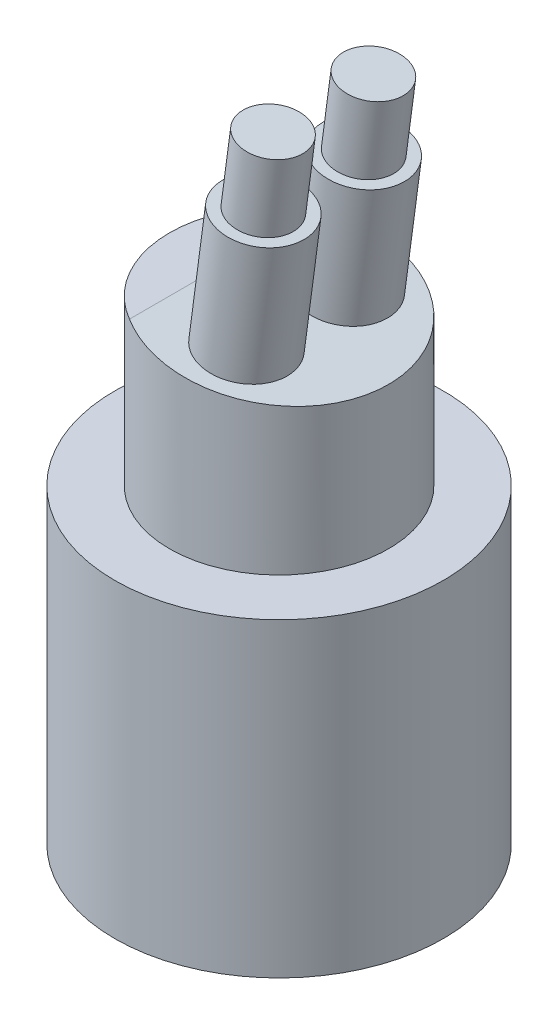
ISO-10303-21;
HEADER;
FILE_DESCRIPTION(('STEP AP214'),'2;1');
FILE_NAME('part.step','',(''),(''),'','','');
FILE_SCHEMA(('AUTOMOTIVE_DESIGN { 1 0 10303 214 1 1 1 1 }'));
ENDSEC;
DATA;
#1=APPLICATION_CONTEXT('core data for automotive mechanical design processes');
#2=APPLICATION_PROTOCOL_DEFINITION('international standard','automotive_design',2000,#1);
#3=PRODUCT_CONTEXT('',#1,'mechanical');
#4=PRODUCT('Part','Part','',(#3));
#5=PRODUCT_RELATED_PRODUCT_CATEGORY('part','',(#4));
#6=PRODUCT_DEFINITION_FORMATION('','',#4);
#7=PRODUCT_DEFINITION_CONTEXT('part definition',#1,'design');
#8=PRODUCT_DEFINITION('design','',#6,#7);
#9=PRODUCT_DEFINITION_SHAPE('','',#8);
#10=(LENGTH_UNIT() NAMED_UNIT(*) SI_UNIT(.MILLI.,.METRE.));
#11=(NAMED_UNIT(*) PLANE_ANGLE_UNIT() SI_UNIT($,.RADIAN.));
#12=(NAMED_UNIT(*) SI_UNIT($,.STERADIAN.) SOLID_ANGLE_UNIT());
#13=UNCERTAINTY_MEASURE_WITH_UNIT(LENGTH_MEASURE(1.E-05),#10,'distance_accuracy_value','');
#14=(GEOMETRIC_REPRESENTATION_CONTEXT(3) GLOBAL_UNCERTAINTY_ASSIGNED_CONTEXT((#13)) GLOBAL_UNIT_ASSIGNED_CONTEXT((#10,
#11,#12)) REPRESENTATION_CONTEXT('',''));
#15=CARTESIAN_POINT('',(0.,0.,0.));
#16=DIRECTION('',(0.,0.,1.));
#17=DIRECTION('',(1.,0.,0.));
#18=AXIS2_PLACEMENT_3D('',#15,#16,#17);
#19=CARTESIAN_POINT('',(2.41871252373174,36.3748520271449,-2.75));
#20=DIRECTION('',(-0.132163720091018,-0.991227900682635,0.));
#21=DIRECTION('',(0.991227900682635,-0.132163720091018,0.));
#22=AXIS2_PLACEMENT_3D('',#19,#20,#21);
#23=CYLINDRICAL_SURFACE('',#22,2.25);
#24=CARTESIAN_POINT('',(0.964911602730543,25.4713451196359,-2.75));
#25=DIRECTION('',(-0.132163720091018,-0.991227900682635,0.));
#26=DIRECTION('',(0.991227900682635,-0.132163720091018,0.));
#27=AXIS2_PLACEMENT_3D('',#24,#25,#26);
#28=CIRCLE('',#27,2.25);
#29=CARTESIAN_POINT('',(3.19517437926647,25.1739767494311,-2.75));
#30=VERTEX_POINT('',#29);
#31=EDGE_CURVE('E40',#30,#30,#28,.F.);
#32=ORIENTED_EDGE('',*,*,#31,.T.);
#33=EDGE_LOOP('',(#32));
#34=FACE_BOUND('',#33,.T.);
#35=CARTESIAN_POINT('',(1.89005764336767,32.4099404244144,-2.75));
#36=DIRECTION('',(0.132163720091018,0.991227900682635,0.));
#37=DIRECTION('',(-0.991227900682635,0.132163720091018,0.));
#38=AXIS2_PLACEMENT_3D('',#35,#36,#37);
#39=CIRCLE('',#38,2.25);
#40=CARTESIAN_POINT('',(-0.340205133168257,32.7073087946192,-2.75));
#41=VERTEX_POINT('',#40);
#42=EDGE_CURVE('E54',#41,#41,#39,.T.);
#43=ORIENTED_EDGE('',*,*,#42,.F.);
#44=EDGE_LOOP('',(#43));
#45=FACE_BOUND('',#44,.T.);
#46=ADVANCED_FACE('F32',(#34,#45),#23,.T.);
#47=CARTESIAN_POINT('',(2.41871252373174,36.3748520271449,2.75));
#48=DIRECTION('',(-0.132163720091018,-0.991227900682635,0.));
#49=DIRECTION('',(0.991227900682635,-0.132163720091018,0.));
#50=AXIS2_PLACEMENT_3D('',#47,#48,#49);
#51=CYLINDRICAL_SURFACE('',#50,2.25);
#52=CARTESIAN_POINT('',(0.964911602730543,25.4713451196359,2.75));
#53=DIRECTION('',(-0.132163720091018,-0.991227900682635,0.));
#54=DIRECTION('',(0.991227900682635,-0.132163720091018,0.));
#55=AXIS2_PLACEMENT_3D('',#52,#53,#54);
#56=CIRCLE('',#55,2.25);
#57=CARTESIAN_POINT('',(3.19517437926647,25.1739767494311,2.75));
#58=VERTEX_POINT('',#57);
#59=EDGE_CURVE('E11',#58,#58,#56,.F.);
#60=ORIENTED_EDGE('',*,*,#59,.T.);
#61=EDGE_LOOP('',(#60));
#62=FACE_BOUND('',#61,.T.);
#63=CARTESIAN_POINT('',(1.89005764336767,32.4099404244144,2.75));
#64=DIRECTION('',(0.132163720091018,0.991227900682635,0.));
#65=DIRECTION('',(-0.991227900682635,0.132163720091018,0.));
#66=AXIS2_PLACEMENT_3D('',#63,#64,#65);
#67=CIRCLE('',#66,2.25);
#68=CARTESIAN_POINT('',(-0.340205133168257,32.7073087946192,2.75));
#69=VERTEX_POINT('',#68);
#70=EDGE_CURVE('E145',#69,#69,#67,.T.);
#71=ORIENTED_EDGE('',*,*,#70,.F.);
#72=EDGE_LOOP('',(#71));
#73=FACE_BOUND('',#72,.T.);
#74=ADVANCED_FACE('F92',(#62,#73),#51,.T.);
#75=CARTESIAN_POINT('',(0.,17.,0.));
#76=DIRECTION('',(0.,-1.,0.));
#77=DIRECTION('',(0.,0.,-1.));
#78=AXIS2_PLACEMENT_3D('',#75,#76,#77);
#79=CYLINDRICAL_SURFACE('',#78,9.);
#80=CARTESIAN_POINT('',(0.,17.,0.));
#81=DIRECTION('',(0.,1.,0.));
#82=DIRECTION('',(0.,0.,1.));
#83=AXIS2_PLACEMENT_3D('',#80,#81,#82);
#84=CIRCLE('',#83,9.);
#85=CARTESIAN_POINT('',(0.,17.,9.));
#86=VERTEX_POINT('',#85);
#87=EDGE_CURVE('E65',#86,#86,#84,.T.);
#88=ORIENTED_EDGE('',*,*,#87,.F.);
#89=EDGE_LOOP('',(#88));
#90=FACE_BOUND('',#89,.T.);
#91=CARTESIAN_POINT('',(0.,0.,0.));
#92=DIRECTION('',(0.,1.,0.));
#93=DIRECTION('',(0.,0.,1.));
#94=AXIS2_PLACEMENT_3D('',#91,#92,#93);
#95=CIRCLE('',#94,9.);
#96=CARTESIAN_POINT('',(0.,0.,9.));
#97=VERTEX_POINT('',#96);
#98=EDGE_CURVE('E62',#97,#97,#95,.T.);
#99=ORIENTED_EDGE('',*,*,#98,.T.);
#100=EDGE_LOOP('',(#99));
#101=FACE_BOUND('',#100,.T.);
#102=ADVANCED_FACE('F34',(#90,#101),#79,.T.);
#103=CARTESIAN_POINT('',(0.,17.,0.));
#104=DIRECTION('',(0.,1.,0.));
#105=DIRECTION('',(0.,0.,1.));
#106=AXIS2_PLACEMENT_3D('',#103,#104,#105);
#107=PLANE('',#106);
#108=CARTESIAN_POINT('',(0.,17.,0.));
#109=DIRECTION('',(0.,1.,0.));
#110=DIRECTION('',(0.,0.,1.));
#111=AXIS2_PLACEMENT_3D('',#108,#109,#110);
#112=CIRCLE('',#111,6.);
#113=CARTESIAN_POINT('',(0.,17.,6.));
#114=VERTEX_POINT('',#113);
#115=EDGE_CURVE('E59',#114,#114,#112,.T.);
#116=ORIENTED_EDGE('',*,*,#115,.F.);
#117=EDGE_LOOP('',(#116));
#118=FACE_BOUND('',#117,.T.);
#119=ORIENTED_EDGE('',*,*,#87,.T.);
#120=EDGE_LOOP('',(#119));
#121=FACE_BOUND('',#120,.T.);
#122=ADVANCED_FACE('F167',(#118,#121),#107,.T.);
#123=CARTESIAN_POINT('',(0.,0.,0.));
#124=DIRECTION('',(0.,1.,0.));
#125=DIRECTION('',(0.,0.,1.));
#126=AXIS2_PLACEMENT_3D('',#123,#124,#125);
#127=PLANE('',#126);
#128=CARTESIAN_POINT('',(0.,0.,0.));
#129=DIRECTION('',(0.,-1.,0.));
#130=DIRECTION('',(0.,0.,-1.));
#131=AXIS2_PLACEMENT_3D('',#128,#129,#130);
#132=CIRCLE('',#131,2.05);
#133=CARTESIAN_POINT('',(0.,0.,-2.05));
#134=VERTEX_POINT('',#133);
#135=EDGE_CURVE('E131',#134,#134,#132,.T.);
#136=ORIENTED_EDGE('',*,*,#135,.F.);
#137=EDGE_LOOP('',(#136));
#138=FACE_BOUND('',#137,.T.);
#139=ORIENTED_EDGE('',*,*,#98,.F.);
#140=EDGE_LOOP('',(#139));
#141=FACE_BOUND('',#140,.T.);
#142=ADVANCED_FACE('F164',(#138,#141),#127,.F.);
#143=CARTESIAN_POINT('',(0.,26.,0.));
#144=DIRECTION('',(0.,-1.,0.));
#145=DIRECTION('',(0.,0.,-1.));
#146=AXIS2_PLACEMENT_3D('',#143,#144,#145);
#147=CYLINDRICAL_SURFACE('',#146,6.);
#148=CARTESIAN_POINT('',(0.,25.6,0.));
#149=DIRECTION('',(-0.132163720091018,-0.991227900682635,0.));
#150=DIRECTION('',(0.991227900682635,-0.132163720091018,0.));
#151=AXIS2_PLACEMENT_3D('',#148,#149,#150);
#152=ELLIPSE('',#151,6.05309838016862,6.);
#153=CARTESIAN_POINT('',(-3.,26.,-5.19615242270664));
#154=VERTEX_POINT('',#153);
#155=CARTESIAN_POINT('',(-3.,26.,5.19615242270663));
#156=VERTEX_POINT('',#155);
#157=EDGE_CURVE('E46',#154,#156,#152,.T.);
#158=ORIENTED_EDGE('',*,*,#157,.T.);
#159=CARTESIAN_POINT('',(0.,26.,0.));
#160=DIRECTION('',(0.,1.,0.));
#161=DIRECTION('',(0.,0.,1.));
#162=AXIS2_PLACEMENT_3D('',#159,#160,#161);
#163=CIRCLE('',#162,6.);
#164=EDGE_CURVE('E53',#154,#156,#163,.T.);
#165=ORIENTED_EDGE('',*,*,#164,.F.);
#166=EDGE_LOOP('',(#158,#165));
#167=FACE_BOUND('',#166,.T.);
#168=ORIENTED_EDGE('',*,*,#115,.T.);
#169=EDGE_LOOP('',(#168));
#170=FACE_BOUND('',#169,.T.);
#171=ADVANCED_FACE('F50',(#167,#170),#147,.T.);
#172=CARTESIAN_POINT('',(0.,26.,0.));
#173=DIRECTION('',(0.,1.,0.));
#174=DIRECTION('',(0.,0.,1.));
#175=AXIS2_PLACEMENT_3D('',#172,#173,#174);
#176=PLANE('',#175);
#177=DIRECTION('',(0.,0.,1.));
#178=VECTOR('',#177,1.);
#179=CARTESIAN_POINT('',(-3.,26.,0.));
#180=LINE('',#179,#178);
#181=EDGE_CURVE('E56',#154,#156,#180,.T.);
#182=ORIENTED_EDGE('',*,*,#181,.F.);
#183=ORIENTED_EDGE('',*,*,#164,.T.);
#184=EDGE_LOOP('',(#182,#183));
#185=FACE_BOUND('',#184,.T.);
#186=ADVANCED_FACE('F61',(#185),#176,.T.);
#187=CARTESIAN_POINT('',(6.,24.8,-8.5));
#188=DIRECTION('',(-0.132163720091018,-0.991227900682635,0.));
#189=DIRECTION('',(0.991227900682635,-0.132163720091018,0.));
#190=AXIS2_PLACEMENT_3D('',#187,#188,#189);
#191=PLANE('',#190);
#192=ORIENTED_EDGE('',*,*,#59,.F.);
#193=EDGE_LOOP('',(#192));
#194=FACE_BOUND('',#193,.T.);
#195=ORIENTED_EDGE('',*,*,#31,.F.);
#196=EDGE_LOOP('',(#195));
#197=FACE_BOUND('',#196,.T.);
#198=ORIENTED_EDGE('',*,*,#157,.F.);
#199=ORIENTED_EDGE('',*,*,#181,.T.);
#200=EDGE_LOOP('',(#198,#199));
#201=FACE_BOUND('',#200,.T.);
#202=ADVANCED_FACE('F57',(#194,#197,#201),#191,.F.);
#203=CARTESIAN_POINT('',(1.89005764336767,32.4099404244144,2.75));
#204=DIRECTION('',(0.132163720091018,0.991227900682635,0.));
#205=DIRECTION('',(-0.991227900682635,0.132163720091018,0.));
#206=AXIS2_PLACEMENT_3D('',#203,#204,#205);
#207=PLANE('',#206);
#208=CARTESIAN_POINT('',(1.89005764336767,32.4099404244144,2.75));
#209=DIRECTION('',(0.132163720091018,0.991227900682635,0.));
#210=DIRECTION('',(-0.991227900682635,0.132163720091018,0.));
#211=AXIS2_PLACEMENT_3D('',#208,#209,#210);
#212=CIRCLE('',#211,1.65);
#213=CARTESIAN_POINT('',(0.254531607241322,32.6280105625645,2.75));
#214=VERTEX_POINT('',#213);
#215=EDGE_CURVE('E134',#214,#214,#212,.T.);
#216=ORIENTED_EDGE('',*,*,#215,.F.);
#217=EDGE_LOOP('',(#216));
#218=FACE_BOUND('',#217,.T.);
#219=ORIENTED_EDGE('',*,*,#70,.T.);
#220=EDGE_LOOP('',(#219));
#221=FACE_BOUND('',#220,.T.);
#222=ADVANCED_FACE('F78',(#218,#221),#207,.T.);
#223=CARTESIAN_POINT('',(1.89005764336767,32.4099404244144,2.75));
#224=DIRECTION('',(0.132163720091018,0.991227900682635,0.));
#225=DIRECTION('',(-0.991227900682635,0.132163720091018,0.));
#226=AXIS2_PLACEMENT_3D('',#223,#224,#225);
#227=CYLINDRICAL_SURFACE('',#226,1.65);
#228=ORIENTED_EDGE('',*,*,#215,.T.);
#229=EDGE_LOOP('',(#228));
#230=FACE_BOUND('',#229,.T.);
#231=CARTESIAN_POINT('',(2.41871252373174,36.3748520271449,2.75));
#232=DIRECTION('',(0.132163720091018,0.991227900682635,0.));
#233=DIRECTION('',(-0.991227900682635,0.132163720091018,0.));
#234=AXIS2_PLACEMENT_3D('',#231,#232,#233);
#235=CIRCLE('',#234,1.65);
#236=CARTESIAN_POINT('',(0.783186487605394,36.5929221652951,2.75));
#237=VERTEX_POINT('',#236);
#238=EDGE_CURVE('E130',#237,#237,#235,.T.);
#239=ORIENTED_EDGE('',*,*,#238,.F.);
#240=EDGE_LOOP('',(#239));
#241=FACE_BOUND('',#240,.T.);
#242=ADVANCED_FACE('F85',(#230,#241),#227,.T.);
#243=CARTESIAN_POINT('',(1.89005764336767,32.4099404244144,-2.75));
#244=DIRECTION('',(0.132163720091018,0.991227900682635,0.));
#245=DIRECTION('',(-0.991227900682635,0.132163720091018,0.));
#246=AXIS2_PLACEMENT_3D('',#243,#244,#245);
#247=PLANE('',#246);
#248=CARTESIAN_POINT('',(1.89005764336767,32.4099404244144,-2.75));
#249=DIRECTION('',(0.132163720091018,0.991227900682635,0.));
#250=DIRECTION('',(-0.991227900682635,0.132163720091018,0.));
#251=AXIS2_PLACEMENT_3D('',#248,#249,#250);
#252=CIRCLE('',#251,1.65);
#253=CARTESIAN_POINT('',(0.254531607241322,32.6280105625645,-2.75));
#254=VERTEX_POINT('',#253);
#255=EDGE_CURVE('E139',#254,#254,#252,.T.);
#256=ORIENTED_EDGE('',*,*,#255,.F.);
#257=EDGE_LOOP('',(#256));
#258=FACE_BOUND('',#257,.T.);
#259=ORIENTED_EDGE('',*,*,#42,.T.);
#260=EDGE_LOOP('',(#259));
#261=FACE_BOUND('',#260,.T.);
#262=ADVANCED_FACE('F111',(#258,#261),#247,.T.);
#263=CARTESIAN_POINT('',(1.89005764336767,32.4099404244144,-2.75));
#264=DIRECTION('',(0.132163720091018,0.991227900682635,0.));
#265=DIRECTION('',(-0.991227900682635,0.132163720091018,0.));
#266=AXIS2_PLACEMENT_3D('',#263,#264,#265);
#267=CYLINDRICAL_SURFACE('',#266,1.65);
#268=ORIENTED_EDGE('',*,*,#255,.T.);
#269=EDGE_LOOP('',(#268));
#270=FACE_BOUND('',#269,.T.);
#271=CARTESIAN_POINT('',(2.41871252373174,36.3748520271449,-2.75));
#272=DIRECTION('',(0.132163720091018,0.991227900682635,0.));
#273=DIRECTION('',(-0.991227900682635,0.132163720091018,0.));
#274=AXIS2_PLACEMENT_3D('',#271,#272,#273);
#275=CIRCLE('',#274,1.65);
#276=CARTESIAN_POINT('',(0.783186487605394,36.5929221652951,-2.75));
#277=VERTEX_POINT('',#276);
#278=EDGE_CURVE('E142',#277,#277,#275,.T.);
#279=ORIENTED_EDGE('',*,*,#278,.F.);
#280=EDGE_LOOP('',(#279));
#281=FACE_BOUND('',#280,.T.);
#282=ADVANCED_FACE('F106',(#270,#281),#267,.T.);
#283=CARTESIAN_POINT('',(2.41871252373174,36.3748520271449,2.75));
#284=DIRECTION('',(0.132163720091018,0.991227900682635,0.));
#285=DIRECTION('',(-0.991227900682635,0.132163720091018,0.));
#286=AXIS2_PLACEMENT_3D('',#283,#284,#285);
#287=PLANE('',#286);
#288=ORIENTED_EDGE('',*,*,#238,.T.);
#289=EDGE_LOOP('',(#288));
#290=FACE_BOUND('',#289,.T.);
#291=ADVANCED_FACE('F102',(#290),#287,.T.);
#292=CARTESIAN_POINT('',(2.41871252373174,36.3748520271449,-2.75));
#293=DIRECTION('',(0.132163720091018,0.991227900682635,0.));
#294=DIRECTION('',(-0.991227900682635,0.132163720091018,0.));
#295=AXIS2_PLACEMENT_3D('',#292,#293,#294);
#296=PLANE('',#295);
#297=ORIENTED_EDGE('',*,*,#278,.T.);
#298=EDGE_LOOP('',(#297));
#299=FACE_BOUND('',#298,.T.);
#300=ADVANCED_FACE('F99',(#299),#296,.T.);
#301=CARTESIAN_POINT('',(0.,5.,0.));
#302=DIRECTION('',(0.,-1.,0.));
#303=DIRECTION('',(0.,0.,-1.));
#304=AXIS2_PLACEMENT_3D('',#301,#302,#303);
#305=CYLINDRICAL_SURFACE('',#304,2.05);
#306=CARTESIAN_POINT('',(0.,5.,0.));
#307=DIRECTION('',(0.,-1.,0.));
#308=DIRECTION('',(0.,0.,-1.));
#309=AXIS2_PLACEMENT_3D('',#306,#307,#308);
#310=CIRCLE('',#309,2.05);
#311=CARTESIAN_POINT('',(0.,5.,-2.05));
#312=VERTEX_POINT('',#311);
#313=EDGE_CURVE('E129',#312,#312,#310,.T.);
#314=ORIENTED_EDGE('',*,*,#313,.F.);
#315=EDGE_LOOP('',(#314));
#316=FACE_BOUND('',#315,.T.);
#317=ORIENTED_EDGE('',*,*,#135,.T.);
#318=EDGE_LOOP('',(#317));
#319=FACE_BOUND('',#318,.T.);
#320=ADVANCED_FACE('F101',(#316,#319),#305,.F.);
#321=CARTESIAN_POINT('',(0.,5.,0.));
#322=DIRECTION('',(0.,-1.,0.));
#323=DIRECTION('',(0.,0.,-1.));
#324=AXIS2_PLACEMENT_3D('',#321,#322,#323);
#325=PLANE('',#324);
#326=ORIENTED_EDGE('',*,*,#313,.T.);
#327=EDGE_LOOP('',(#326));
#328=FACE_BOUND('',#327,.T.);
#329=ADVANCED_FACE('F121',(#328),#325,.T.);
#330=CLOSED_SHELL('',(#46,#74,#102,#122,#142,#171,#186,#202,#222,#242,#262,#282,#291,#300,#320,#329));
#331=MANIFOLD_SOLID_BREP('B2',#330);
#332=ADVANCED_BREP_SHAPE_REPRESENTATION('',(#18,#331),#14);
#333=SHAPE_DEFINITION_REPRESENTATION(#9,#332);
ENDSEC;
END-ISO-10303-21;
